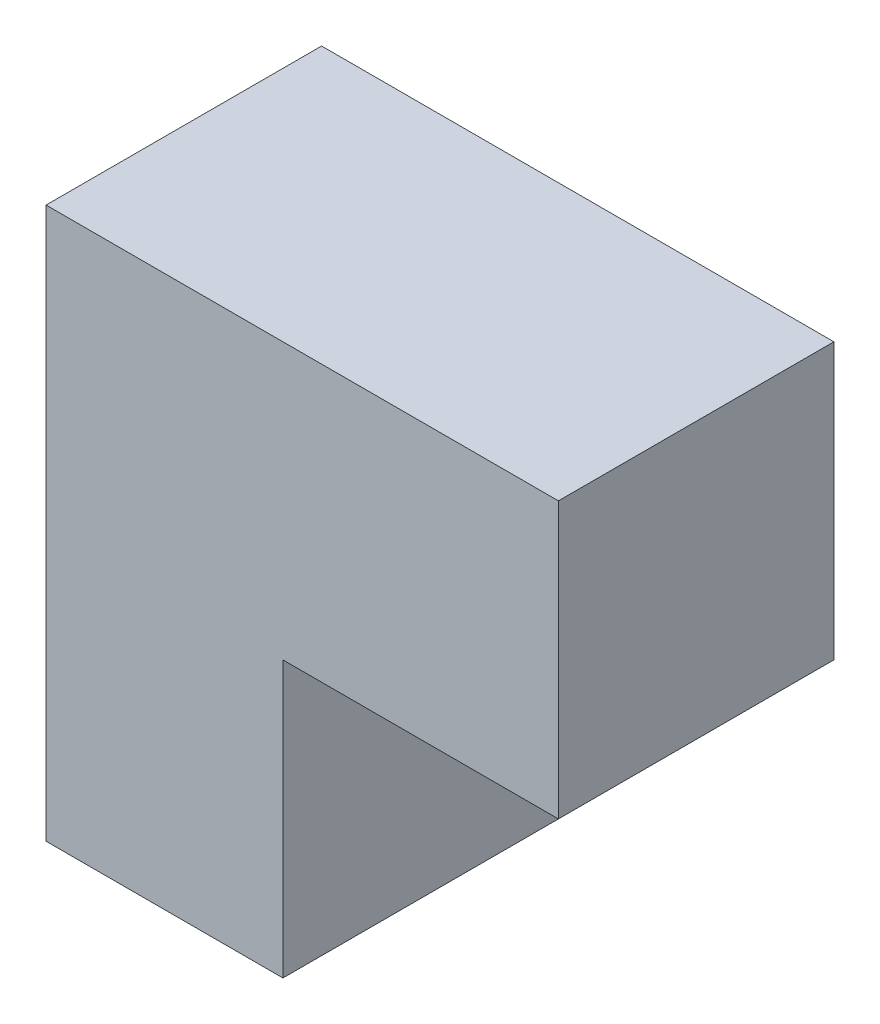
ISO-10303-21;
HEADER;
FILE_DESCRIPTION(('STEP AP214'),'2;1');
FILE_NAME('part.step','',(''),(''),'','','');
FILE_SCHEMA(('AUTOMOTIVE_DESIGN { 1 0 10303 214 1 1 1 1 }'));
ENDSEC;
DATA;
#1=APPLICATION_CONTEXT('core data for automotive mechanical design processes');
#2=APPLICATION_PROTOCOL_DEFINITION('international standard','automotive_design',2000,#1);
#3=PRODUCT_CONTEXT('',#1,'mechanical');
#4=PRODUCT('Part','Part','',(#3));
#5=PRODUCT_RELATED_PRODUCT_CATEGORY('part','',(#4));
#6=PRODUCT_DEFINITION_FORMATION('','',#4);
#7=PRODUCT_DEFINITION_CONTEXT('part definition',#1,'design');
#8=PRODUCT_DEFINITION('design','',#6,#7);
#9=PRODUCT_DEFINITION_SHAPE('','',#8);
#10=(LENGTH_UNIT() NAMED_UNIT(*) SI_UNIT(.MILLI.,.METRE.));
#11=(NAMED_UNIT(*) PLANE_ANGLE_UNIT() SI_UNIT($,.RADIAN.));
#12=(NAMED_UNIT(*) SI_UNIT($,.STERADIAN.) SOLID_ANGLE_UNIT());
#13=UNCERTAINTY_MEASURE_WITH_UNIT(LENGTH_MEASURE(1.E-05),#10,'distance_accuracy_value','');
#14=(GEOMETRIC_REPRESENTATION_CONTEXT(3) GLOBAL_UNCERTAINTY_ASSIGNED_CONTEXT((#13)) GLOBAL_UNIT_ASSIGNED_CONTEXT((#10,
#11,#12)) REPRESENTATION_CONTEXT('',''));
#15=CARTESIAN_POINT('',(0.,0.,0.));
#16=DIRECTION('',(0.,0.,1.));
#17=DIRECTION('',(1.,0.,0.));
#18=AXIS2_PLACEMENT_3D('',#15,#16,#17);
#19=CARTESIAN_POINT('',(25.7906145251397,0.,30.));
#20=DIRECTION('',(0.,1.,0.));
#21=DIRECTION('',(0.,0.,1.));
#22=AXIS2_PLACEMENT_3D('',#19,#20,#21);
#23=PLANE('',#22);
#24=DIRECTION('',(1.,0.,0.));
#25=VECTOR('',#24,1.);
#26=CARTESIAN_POINT('',(25.7906145251397,0.,0.));
#27=LINE('',#26,#25);
#28=CARTESIAN_POINT('',(0.,0.,0.));
#29=VERTEX_POINT('',#28);
#30=CARTESIAN_POINT('',(25.7906145251397,0.,0.));
#31=VERTEX_POINT('',#30);
#32=EDGE_CURVE('E116',#29,#31,#27,.T.);
#33=ORIENTED_EDGE('',*,*,#32,.T.);
#34=DIRECTION('',(0.,0.,-1.));
#35=VECTOR('',#34,1.);
#36=CARTESIAN_POINT('',(25.7906145251397,0.,30.));
#37=LINE('',#36,#35);
#38=CARTESIAN_POINT('',(25.7906145251397,0.,30.));
#39=VERTEX_POINT('',#38);
#40=EDGE_CURVE('E11',#39,#31,#37,.T.);
#41=ORIENTED_EDGE('',*,*,#40,.F.);
#42=DIRECTION('',(1.,0.,0.));
#43=VECTOR('',#42,1.);
#44=CARTESIAN_POINT('',(25.7906145251397,0.,30.));
#45=LINE('',#44,#43);
#46=CARTESIAN_POINT('',(0.,0.,30.));
#47=VERTEX_POINT('',#46);
#48=EDGE_CURVE('E126',#47,#39,#45,.T.);
#49=ORIENTED_EDGE('',*,*,#48,.F.);
#50=DIRECTION('',(0.,0.,-1.));
#51=VECTOR('',#50,1.);
#52=CARTESIAN_POINT('',(0.,0.,30.));
#53=LINE('',#52,#51);
#54=EDGE_CURVE('E112',#47,#29,#53,.T.);
#55=ORIENTED_EDGE('',*,*,#54,.T.);
#56=EDGE_LOOP('',(#33,#41,#49,#55));
#57=FACE_BOUND('',#56,.T.);
#58=ADVANCED_FACE('F32',(#57),#23,.F.);
#59=CARTESIAN_POINT('',(25.7906145251397,30.,30.));
#60=DIRECTION('',(-1.,0.,0.));
#61=DIRECTION('',(0.,-1.,0.));
#62=AXIS2_PLACEMENT_3D('',#59,#60,#61);
#63=PLANE('',#62);
#64=DIRECTION('',(0.,1.,0.));
#65=VECTOR('',#64,1.);
#66=CARTESIAN_POINT('',(25.7906145251397,30.,0.));
#67=LINE('',#66,#65);
#68=CARTESIAN_POINT('',(25.7906145251397,30.,0.));
#69=VERTEX_POINT('',#68);
#70=EDGE_CURVE('E119',#31,#69,#67,.T.);
#71=ORIENTED_EDGE('',*,*,#70,.T.);
#72=DIRECTION('',(0.,0.,-1.));
#73=VECTOR('',#72,1.);
#74=CARTESIAN_POINT('',(25.7906145251397,30.,30.));
#75=LINE('',#74,#73);
#76=CARTESIAN_POINT('',(25.7906145251397,30.,30.));
#77=VERTEX_POINT('',#76);
#78=EDGE_CURVE('E40',#77,#69,#75,.T.);
#79=ORIENTED_EDGE('',*,*,#78,.F.);
#80=DIRECTION('',(0.,1.,0.));
#81=VECTOR('',#80,1.);
#82=CARTESIAN_POINT('',(25.7906145251397,30.,30.));
#83=LINE('',#82,#81);
#84=EDGE_CURVE('E85',#39,#77,#83,.T.);
#85=ORIENTED_EDGE('',*,*,#84,.F.);
#86=ORIENTED_EDGE('',*,*,#40,.T.);
#87=EDGE_LOOP('',(#71,#79,#85,#86));
#88=FACE_BOUND('',#87,.T.);
#89=ADVANCED_FACE('F150',(#88),#63,.F.);
#90=CARTESIAN_POINT('',(55.7906145251397,30.,30.));
#91=DIRECTION('',(0.,1.,0.));
#92=DIRECTION('',(-1.,0.,0.));
#93=AXIS2_PLACEMENT_3D('',#90,#91,#92);
#94=PLANE('',#93);
#95=DIRECTION('',(1.,0.,0.));
#96=VECTOR('',#95,1.);
#97=CARTESIAN_POINT('',(55.7906145251397,30.,0.));
#98=LINE('',#97,#96);
#99=CARTESIAN_POINT('',(55.7906145251397,30.,0.));
#100=VERTEX_POINT('',#99);
#101=EDGE_CURVE('E121',#69,#100,#98,.T.);
#102=ORIENTED_EDGE('',*,*,#101,.T.);
#103=DIRECTION('',(0.,0.,-1.));
#104=VECTOR('',#103,1.);
#105=CARTESIAN_POINT('',(55.7906145251397,30.,30.));
#106=LINE('',#105,#104);
#107=CARTESIAN_POINT('',(55.7906145251397,30.,30.));
#108=VERTEX_POINT('',#107);
#109=EDGE_CURVE('E107',#108,#100,#106,.T.);
#110=ORIENTED_EDGE('',*,*,#109,.F.);
#111=DIRECTION('',(1.,0.,0.));
#112=VECTOR('',#111,1.);
#113=CARTESIAN_POINT('',(55.7906145251397,30.,30.));
#114=LINE('',#113,#112);
#115=EDGE_CURVE('E98',#77,#108,#114,.T.);
#116=ORIENTED_EDGE('',*,*,#115,.F.);
#117=ORIENTED_EDGE('',*,*,#78,.T.);
#118=EDGE_LOOP('',(#102,#110,#116,#117));
#119=FACE_BOUND('',#118,.T.);
#120=ADVANCED_FACE('F132',(#119),#94,.F.);
#121=CARTESIAN_POINT('',(55.7906145251397,60.,30.));
#122=DIRECTION('',(-1.,0.,0.));
#123=DIRECTION('',(0.,-1.,0.));
#124=AXIS2_PLACEMENT_3D('',#121,#122,#123);
#125=PLANE('',#124);
#126=DIRECTION('',(0.,1.,0.));
#127=VECTOR('',#126,1.);
#128=CARTESIAN_POINT('',(55.7906145251397,60.,0.));
#129=LINE('',#128,#127);
#130=CARTESIAN_POINT('',(55.7906145251397,60.,0.));
#131=VERTEX_POINT('',#130);
#132=EDGE_CURVE('E106',#100,#131,#129,.T.);
#133=ORIENTED_EDGE('',*,*,#132,.T.);
#134=DIRECTION('',(0.,0.,-1.));
#135=VECTOR('',#134,1.);
#136=CARTESIAN_POINT('',(55.7906145251397,60.,30.));
#137=LINE('',#136,#135);
#138=CARTESIAN_POINT('',(55.7906145251397,60.,30.));
#139=VERTEX_POINT('',#138);
#140=EDGE_CURVE('E103',#139,#131,#137,.T.);
#141=ORIENTED_EDGE('',*,*,#140,.F.);
#142=DIRECTION('',(0.,1.,0.));
#143=VECTOR('',#142,1.);
#144=CARTESIAN_POINT('',(55.7906145251397,60.,30.));
#145=LINE('',#144,#143);
#146=EDGE_CURVE('E92',#108,#139,#145,.T.);
#147=ORIENTED_EDGE('',*,*,#146,.F.);
#148=ORIENTED_EDGE('',*,*,#109,.T.);
#149=EDGE_LOOP('',(#133,#141,#147,#148));
#150=FACE_BOUND('',#149,.T.);
#151=ADVANCED_FACE('F104',(#150),#125,.F.);
#152=CARTESIAN_POINT('',(0.,60.,30.));
#153=DIRECTION('',(0.,-1.,0.));
#154=DIRECTION('',(0.,0.,-1.));
#155=AXIS2_PLACEMENT_3D('',#152,#153,#154);
#156=PLANE('',#155);
#157=DIRECTION('',(-1.,0.,0.));
#158=VECTOR('',#157,1.);
#159=CARTESIAN_POINT('',(0.,60.,0.));
#160=LINE('',#159,#158);
#161=CARTESIAN_POINT('',(0.,60.,0.));
#162=VERTEX_POINT('',#161);
#163=EDGE_CURVE('E71',#131,#162,#160,.T.);
#164=ORIENTED_EDGE('',*,*,#163,.T.);
#165=DIRECTION('',(0.,0.,-1.));
#166=VECTOR('',#165,1.);
#167=CARTESIAN_POINT('',(0.,60.,30.));
#168=LINE('',#167,#166);
#169=CARTESIAN_POINT('',(0.,60.,30.));
#170=VERTEX_POINT('',#169);
#171=EDGE_CURVE('E108',#170,#162,#168,.T.);
#172=ORIENTED_EDGE('',*,*,#171,.F.);
#173=DIRECTION('',(-1.,0.,0.));
#174=VECTOR('',#173,1.);
#175=CARTESIAN_POINT('',(0.,60.,30.));
#176=LINE('',#175,#174);
#177=EDGE_CURVE('E96',#139,#170,#176,.T.);
#178=ORIENTED_EDGE('',*,*,#177,.F.);
#179=ORIENTED_EDGE('',*,*,#140,.T.);
#180=EDGE_LOOP('',(#164,#172,#178,#179));
#181=FACE_BOUND('',#180,.T.);
#182=ADVANCED_FACE('F110',(#181),#156,.F.);
#183=CARTESIAN_POINT('',(0.,0.,30.));
#184=DIRECTION('',(1.,0.,0.));
#185=DIRECTION('',(0.,0.,-1.));
#186=AXIS2_PLACEMENT_3D('',#183,#184,#185);
#187=PLANE('',#186);
#188=DIRECTION('',(0.,-1.,0.));
#189=VECTOR('',#188,1.);
#190=CARTESIAN_POINT('',(0.,0.,0.));
#191=LINE('',#190,#189);
#192=EDGE_CURVE('E77',#162,#29,#191,.T.);
#193=ORIENTED_EDGE('',*,*,#192,.T.);
#194=ORIENTED_EDGE('',*,*,#54,.F.);
#195=DIRECTION('',(0.,-1.,0.));
#196=VECTOR('',#195,1.);
#197=CARTESIAN_POINT('',(0.,0.,30.));
#198=LINE('',#197,#196);
#199=EDGE_CURVE('E48',#170,#47,#198,.T.);
#200=ORIENTED_EDGE('',*,*,#199,.F.);
#201=ORIENTED_EDGE('',*,*,#171,.T.);
#202=EDGE_LOOP('',(#193,#194,#200,#201));
#203=FACE_BOUND('',#202,.T.);
#204=ADVANCED_FACE('F139',(#203),#187,.F.);
#205=CARTESIAN_POINT('',(0.,0.,30.));
#206=DIRECTION('',(0.,0.,-1.));
#207=DIRECTION('',(-1.,0.,0.));
#208=AXIS2_PLACEMENT_3D('',#205,#206,#207);
#209=PLANE('',#208);
#210=ORIENTED_EDGE('',*,*,#48,.T.);
#211=ORIENTED_EDGE('',*,*,#84,.T.);
#212=ORIENTED_EDGE('',*,*,#115,.T.);
#213=ORIENTED_EDGE('',*,*,#146,.T.);
#214=ORIENTED_EDGE('',*,*,#177,.T.);
#215=ORIENTED_EDGE('',*,*,#199,.T.);
#216=EDGE_LOOP('',(#210,#211,#212,#213,#214,#215));
#217=FACE_BOUND('',#216,.T.);
#218=ADVANCED_FACE('F94',(#217),#209,.F.);
#219=CARTESIAN_POINT('',(0.,0.,0.));
#220=DIRECTION('',(0.,0.,-1.));
#221=DIRECTION('',(-1.,0.,0.));
#222=AXIS2_PLACEMENT_3D('',#219,#220,#221);
#223=PLANE('',#222);
#224=ORIENTED_EDGE('',*,*,#32,.F.);
#225=ORIENTED_EDGE('',*,*,#192,.F.);
#226=ORIENTED_EDGE('',*,*,#163,.F.);
#227=ORIENTED_EDGE('',*,*,#132,.F.);
#228=ORIENTED_EDGE('',*,*,#101,.F.);
#229=ORIENTED_EDGE('',*,*,#70,.F.);
#230=EDGE_LOOP('',(#224,#225,#226,#227,#228,#229));
#231=FACE_BOUND('',#230,.T.);
#232=ADVANCED_FACE('F135',(#231),#223,.T.);
#233=CLOSED_SHELL('',(#58,#89,#120,#151,#182,#204,#218,#232));
#234=MANIFOLD_SOLID_BREP('B2',#233);
#235=ADVANCED_BREP_SHAPE_REPRESENTATION('',(#18,#234),#14);
#236=SHAPE_DEFINITION_REPRESENTATION(#9,#235);
ENDSEC;
END-ISO-10303-21;
